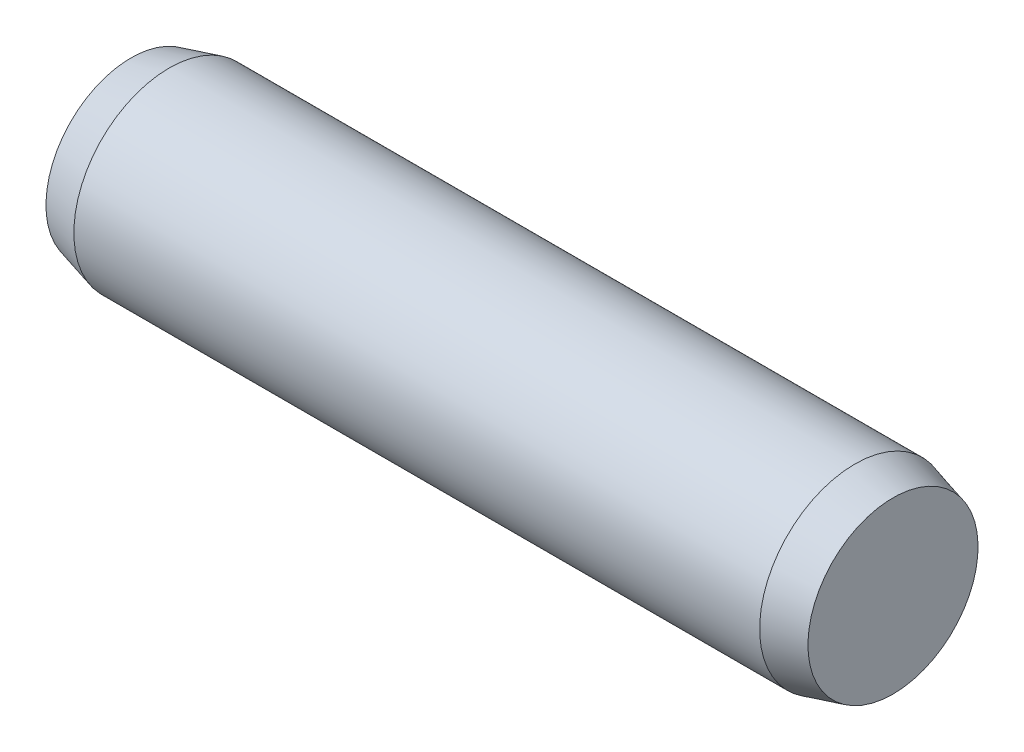
ISO-10303-21;
HEADER;
FILE_DESCRIPTION(('STEP AP214'),'2;1');
FILE_NAME('part.step','',(''),(''),'','','');
FILE_SCHEMA(('AUTOMOTIVE_DESIGN { 1 0 10303 214 1 1 1 1 }'));
ENDSEC;
DATA;
#1=APPLICATION_CONTEXT('core data for automotive mechanical design processes');
#2=APPLICATION_PROTOCOL_DEFINITION('international standard','automotive_design',2000,#1);
#3=PRODUCT_CONTEXT('',#1,'mechanical');
#4=PRODUCT('Part','Part','',(#3));
#5=PRODUCT_RELATED_PRODUCT_CATEGORY('part','',(#4));
#6=PRODUCT_DEFINITION_FORMATION('','',#4);
#7=PRODUCT_DEFINITION_CONTEXT('part definition',#1,'design');
#8=PRODUCT_DEFINITION('design','',#6,#7);
#9=PRODUCT_DEFINITION_SHAPE('','',#8);
#10=(LENGTH_UNIT() NAMED_UNIT(*) SI_UNIT(.MILLI.,.METRE.));
#11=(NAMED_UNIT(*) PLANE_ANGLE_UNIT() SI_UNIT($,.RADIAN.));
#12=(NAMED_UNIT(*) SI_UNIT($,.STERADIAN.) SOLID_ANGLE_UNIT());
#13=UNCERTAINTY_MEASURE_WITH_UNIT(LENGTH_MEASURE(1.E-05),#10,'distance_accuracy_value','');
#14=(GEOMETRIC_REPRESENTATION_CONTEXT(3) GLOBAL_UNCERTAINTY_ASSIGNED_CONTEXT((#13)) GLOBAL_UNIT_ASSIGNED_CONTEXT((#10,
#11,#12)) REPRESENTATION_CONTEXT('',''));
#15=CARTESIAN_POINT('',(0.,0.,0.));
#16=DIRECTION('',(0.,0.,1.));
#17=DIRECTION('',(1.,0.,0.));
#18=AXIS2_PLACEMENT_3D('',#15,#16,#17);
#19=CARTESIAN_POINT('',(6.00000000000422,0.669615242275545,8.74300631892311E-13));
#20=DIRECTION('',(-1.00000000000001,0.,0.));
#21=DIRECTION('',(0.,-1.0000000000001,0.));
#22=AXIS2_PLACEMENT_3D('',#19,#20,#21);
#23=PLANE('',#22);
#24=CARTESIAN_POINT('',(6.00000000000456,4.57966997657877E-12,2.63677968348475E-13));
#25=DIRECTION('',(-1.00000000000001,0.,0.));
#26=DIRECTION('',(0.,-1.0000000000001,0.));
#27=AXIS2_PLACEMENT_3D('',#24,#25,#26);
#28=CIRCLE('',#27,0.669615242270664);
#29=CARTESIAN_POINT('',(6.00000000000457,-0.669615242266153,3.06090208259159E-13));
#30=VERTEX_POINT('',#29);
#31=EDGE_CURVE('E10',#30,#30,#28,.T.);
#32=ORIENTED_EDGE('',*,*,#31,.F.);
#33=EDGE_LOOP('',(#32));
#34=FACE_BOUND('',#33,.T.);
#35=ADVANCED_FACE('F32',(#34),#23,.F.);
#36=CARTESIAN_POINT('',(6.00000000000456,4.57966997657877E-12,2.63677968348475E-13));
#37=DIRECTION('',(-1.00000000000001,0.,0.));
#38=DIRECTION('',(0.,-1.0000000000001,0.));
#39=AXIS2_PLACEMENT_3D('',#36,#37,#38);
#40=CONICAL_SURFACE('',#39,0.669615242270664,0.26179938779915);
#41=CARTESIAN_POINT('',(5.70000000000365,3.96904731303493E-12,-1.11022302462516E-13));
#42=DIRECTION('',(-1.00000000000001,0.,0.));
#43=DIRECTION('',(0.,-1.0000000000001,0.));
#44=AXIS2_PLACEMENT_3D('',#41,#42,#43);
#45=CIRCLE('',#44,0.750000000000001);
#46=CARTESIAN_POINT('',(5.70000000000366,-0.749999999996109,0.));
#47=VERTEX_POINT('',#46);
#48=EDGE_CURVE('E38',#47,#47,#45,.T.);
#49=ORIENTED_EDGE('',*,*,#48,.F.);
#50=EDGE_LOOP('',(#49));
#51=FACE_BOUND('',#50,.T.);
#52=ORIENTED_EDGE('',*,*,#31,.T.);
#53=EDGE_LOOP('',(#52));
#54=FACE_BOUND('',#53,.T.);
#55=ADVANCED_FACE('F62',(#51,#54),#40,.T.);
#56=CARTESIAN_POINT('',(0.,0.,0.));
#57=DIRECTION('',(-1.00000000000001,0.,0.));
#58=DIRECTION('',(0.,-1.0000000000001,0.));
#59=AXIS2_PLACEMENT_3D('',#56,#57,#58);
#60=CYLINDRICAL_SURFACE('',#59,0.75);
#61=CARTESIAN_POINT('',(0.300000000004241,3.80251385934116E-12,9.99200722162641E-13));
#62=DIRECTION('',(-1.00000000000001,0.,0.));
#63=DIRECTION('',(0.,-1.0000000000001,0.));
#64=AXIS2_PLACEMENT_3D('',#61,#62,#63);
#65=CIRCLE('',#64,0.75);
#66=CARTESIAN_POINT('',(0.30000000000425,-0.749999999996275,1.04670438982879E-12));
#67=VERTEX_POINT('',#66);
#68=EDGE_CURVE('E42',#67,#67,#65,.T.);
#69=ORIENTED_EDGE('',*,*,#68,.F.);
#70=EDGE_LOOP('',(#69));
#71=FACE_BOUND('',#70,.T.);
#72=ORIENTED_EDGE('',*,*,#48,.T.);
#73=EDGE_LOOP('',(#72));
#74=FACE_BOUND('',#73,.T.);
#75=ADVANCED_FACE('F57',(#71,#74),#60,.T.);
#76=CARTESIAN_POINT('',(0.300000000004241,3.80251385934116E-12,9.99200722162641E-13));
#77=DIRECTION('',(1.00000000000001,0.,0.));
#78=DIRECTION('',(0.,1.0000000000001,0.));
#79=AXIS2_PLACEMENT_3D('',#76,#77,#78);
#80=CONICAL_SURFACE('',#79,0.75,0.26179938779915);
#81=CARTESIAN_POINT('',(0.,0.,0.));
#82=DIRECTION('',(-1.00000000000001,0.,0.));
#83=DIRECTION('',(0.,-1.0000000000001,0.));
#84=AXIS2_PLACEMENT_3D('',#81,#82,#83);
#85=CIRCLE('',#84,0.669615242270663);
#86=CARTESIAN_POINT('',(0.,-0.669615242270732,0.));
#87=VERTEX_POINT('',#86);
#88=EDGE_CURVE('E46',#87,#87,#85,.T.);
#89=ORIENTED_EDGE('',*,*,#88,.F.);
#90=EDGE_LOOP('',(#89));
#91=FACE_BOUND('',#90,.T.);
#92=ORIENTED_EDGE('',*,*,#68,.T.);
#93=EDGE_LOOP('',(#92));
#94=FACE_BOUND('',#93,.T.);
#95=ADVANCED_FACE('F54',(#91,#94),#80,.T.);
#96=CARTESIAN_POINT('',(5.49560397189452E-12,0.669615242276433,-4.9960036108132E-13));
#97=DIRECTION('',(1.00000000000001,0.,0.));
#98=DIRECTION('',(0.,1.0000000000001,0.));
#99=AXIS2_PLACEMENT_3D('',#96,#97,#98);
#100=PLANE('',#99);
#101=ORIENTED_EDGE('',*,*,#88,.T.);
#102=EDGE_LOOP('',(#101));
#103=FACE_BOUND('',#102,.T.);
#104=ADVANCED_FACE('F52',(#103),#100,.F.);
#105=CLOSED_SHELL('',(#35,#55,#75,#95,#104));
#106=MANIFOLD_SOLID_BREP('B2',#105);
#107=ADVANCED_BREP_SHAPE_REPRESENTATION('',(#18,#106),#14);
#108=SHAPE_DEFINITION_REPRESENTATION(#9,#107);
ENDSEC;
END-ISO-10303-21;
